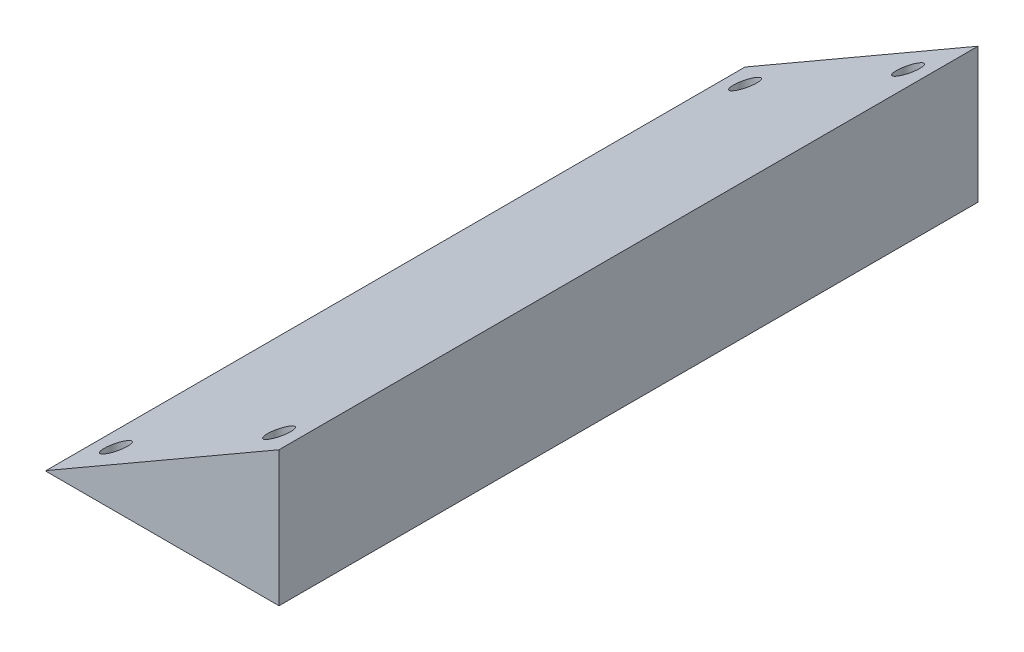
ISO-10303-21;
HEADER;
FILE_DESCRIPTION(('STEP AP214'),'2;1');
FILE_NAME('part.step','',(''),(''),'','','');
FILE_SCHEMA(('AUTOMOTIVE_DESIGN { 1 0 10303 214 1 1 1 1 }'));
ENDSEC;
DATA;
#1=APPLICATION_CONTEXT('core data for automotive mechanical design processes');
#2=APPLICATION_PROTOCOL_DEFINITION('international standard','automotive_design',2000,#1);
#3=PRODUCT_CONTEXT('',#1,'mechanical');
#4=PRODUCT('Part','Part','',(#3));
#5=PRODUCT_RELATED_PRODUCT_CATEGORY('part','',(#4));
#6=PRODUCT_DEFINITION_FORMATION('','',#4);
#7=PRODUCT_DEFINITION_CONTEXT('part definition',#1,'design');
#8=PRODUCT_DEFINITION('design','',#6,#7);
#9=PRODUCT_DEFINITION_SHAPE('','',#8);
#10=(LENGTH_UNIT() NAMED_UNIT(*) SI_UNIT(.MILLI.,.METRE.));
#11=(NAMED_UNIT(*) PLANE_ANGLE_UNIT() SI_UNIT($,.RADIAN.));
#12=(NAMED_UNIT(*) SI_UNIT($,.STERADIAN.) SOLID_ANGLE_UNIT());
#13=UNCERTAINTY_MEASURE_WITH_UNIT(LENGTH_MEASURE(1.E-05),#10,'distance_accuracy_value','');
#14=(GEOMETRIC_REPRESENTATION_CONTEXT(3) GLOBAL_UNCERTAINTY_ASSIGNED_CONTEXT((#13)) GLOBAL_UNIT_ASSIGNED_CONTEXT((#10,
#11,#12)) REPRESENTATION_CONTEXT('',''));
#15=CARTESIAN_POINT('',(0.,0.,0.));
#16=DIRECTION('',(0.,0.,1.));
#17=DIRECTION('',(1.,0.,0.));
#18=AXIS2_PLACEMENT_3D('',#15,#16,#17);
#19=CARTESIAN_POINT('',(-25.,0.132486540518385,75.));
#20=DIRECTION('',(1.,0.,0.));
#21=DIRECTION('',(0.,1.,0.));
#22=AXIS2_PLACEMENT_3D('',#19,#20,#21);
#23=PLANE('',#22);
#24=DIRECTION('',(0.,-1.,0.));
#25=VECTOR('',#24,1.);
#26=CARTESIAN_POINT('',(-25.,0.132486540518385,-75.));
#27=LINE('',#26,#25);
#28=CARTESIAN_POINT('',(-25.,0.132486540518385,-75.));
#29=VERTEX_POINT('',#28);
#30=CARTESIAN_POINT('',(-25.,0.,-75.));
#31=VERTEX_POINT('',#30);
#32=EDGE_CURVE('E111',#29,#31,#27,.T.);
#33=ORIENTED_EDGE('',*,*,#32,.T.);
#34=DIRECTION('',(0.,0.,-1.));
#35=VECTOR('',#34,1.);
#36=CARTESIAN_POINT('',(-25.,0.,75.));
#37=LINE('',#36,#35);
#38=CARTESIAN_POINT('',(-25.,0.,75.));
#39=VERTEX_POINT('',#38);
#40=EDGE_CURVE('E11',#39,#31,#37,.T.);
#41=ORIENTED_EDGE('',*,*,#40,.F.);
#42=DIRECTION('',(0.,-1.,0.));
#43=VECTOR('',#42,1.);
#44=CARTESIAN_POINT('',(-25.,0.132486540518385,75.));
#45=LINE('',#44,#43);
#46=CARTESIAN_POINT('',(-25.,0.132486540518385,75.));
#47=VERTEX_POINT('',#46);
#48=EDGE_CURVE('E94',#47,#39,#45,.T.);
#49=ORIENTED_EDGE('',*,*,#48,.F.);
#50=DIRECTION('',(0.,0.,-1.));
#51=VECTOR('',#50,1.);
#52=CARTESIAN_POINT('',(-25.,0.132486540518385,75.));
#53=LINE('',#52,#51);
#54=EDGE_CURVE('E107',#47,#29,#53,.T.);
#55=ORIENTED_EDGE('',*,*,#54,.T.);
#56=EDGE_LOOP('',(#33,#41,#49,#55));
#57=FACE_BOUND('',#56,.T.);
#58=ADVANCED_FACE('F40',(#57),#23,.F.);
#59=CARTESIAN_POINT('',(-25.,0.,75.));
#60=DIRECTION('',(0.,1.,0.));
#61=DIRECTION('',(0.,0.,1.));
#62=AXIS2_PLACEMENT_3D('',#59,#60,#61);
#63=PLANE('',#62);
#64=CARTESIAN_POINT('',(17.5,0.,67.5));
#65=DIRECTION('',(0.,-1.,0.));
#66=DIRECTION('',(0.,0.,-1.));
#67=AXIS2_PLACEMENT_3D('',#64,#65,#66);
#68=CIRCLE('',#67,2.5);
#69=CARTESIAN_POINT('',(17.5,0.,65.));
#70=VERTEX_POINT('',#69);
#71=EDGE_CURVE('E251',#70,#70,#68,.T.);
#72=ORIENTED_EDGE('',*,*,#71,.F.);
#73=EDGE_LOOP('',(#72));
#74=FACE_BOUND('',#73,.T.);
#75=CARTESIAN_POINT('',(-17.5,0.,-67.5));
#76=DIRECTION('',(0.,-1.,0.));
#77=DIRECTION('',(0.,0.,-1.));
#78=AXIS2_PLACEMENT_3D('',#75,#76,#77);
#79=CIRCLE('',#78,2.5);
#80=CARTESIAN_POINT('',(-17.5,0.,-70.));
#81=VERTEX_POINT('',#80);
#82=EDGE_CURVE('E247',#81,#81,#79,.T.);
#83=ORIENTED_EDGE('',*,*,#82,.F.);
#84=EDGE_LOOP('',(#83));
#85=FACE_BOUND('',#84,.T.);
#86=CARTESIAN_POINT('',(17.5,0.,-67.5));
#87=DIRECTION('',(0.,-1.,0.));
#88=DIRECTION('',(0.,0.,-1.));
#89=AXIS2_PLACEMENT_3D('',#86,#87,#88);
#90=CIRCLE('',#89,2.5);
#91=CARTESIAN_POINT('',(17.5,0.,-70.));
#92=VERTEX_POINT('',#91);
#93=EDGE_CURVE('E239',#92,#92,#90,.T.);
#94=ORIENTED_EDGE('',*,*,#93,.F.);
#95=EDGE_LOOP('',(#94));
#96=FACE_BOUND('',#95,.T.);
#97=CARTESIAN_POINT('',(-17.5,0.,67.5));
#98=DIRECTION('',(0.,-1.,0.));
#99=DIRECTION('',(0.,0.,-1.));
#100=AXIS2_PLACEMENT_3D('',#97,#98,#99);
#101=CIRCLE('',#100,2.5);
#102=CARTESIAN_POINT('',(-17.5,0.,65.));
#103=VERTEX_POINT('',#102);
#104=EDGE_CURVE('E130',#103,#103,#101,.T.);
#105=ORIENTED_EDGE('',*,*,#104,.F.);
#106=EDGE_LOOP('',(#105));
#107=FACE_BOUND('',#106,.T.);
#108=DIRECTION('',(1.,0.,0.));
#109=VECTOR('',#108,1.);
#110=CARTESIAN_POINT('',(-25.,0.,-75.));
#111=LINE('',#110,#109);
#112=CARTESIAN_POINT('',(25.,0.,-75.));
#113=VERTEX_POINT('',#112);
#114=EDGE_CURVE('E99',#31,#113,#111,.T.);
#115=ORIENTED_EDGE('',*,*,#114,.T.);
#116=DIRECTION('',(0.,0.,-1.));
#117=VECTOR('',#116,1.);
#118=CARTESIAN_POINT('',(25.,0.,75.));
#119=LINE('',#118,#117);
#120=CARTESIAN_POINT('',(25.,0.,75.));
#121=VERTEX_POINT('',#120);
#122=EDGE_CURVE('E50',#121,#113,#119,.T.);
#123=ORIENTED_EDGE('',*,*,#122,.F.);
#124=DIRECTION('',(1.,0.,0.));
#125=VECTOR('',#124,1.);
#126=CARTESIAN_POINT('',(-25.,0.,75.));
#127=LINE('',#126,#125);
#128=EDGE_CURVE('E89',#39,#121,#127,.T.);
#129=ORIENTED_EDGE('',*,*,#128,.F.);
#130=ORIENTED_EDGE('',*,*,#40,.T.);
#131=EDGE_LOOP('',(#115,#123,#129,#130));
#132=FACE_BOUND('',#131,.T.);
#133=ADVANCED_FACE('F98',(#74,#85,#96,#107,#132),#63,.F.);
#134=CARTESIAN_POINT('',(25.,0.,75.));
#135=DIRECTION('',(-1.,0.,0.));
#136=DIRECTION('',(0.,-1.,0.));
#137=AXIS2_PLACEMENT_3D('',#134,#135,#136);
#138=PLANE('',#137);
#139=DIRECTION('',(0.,1.,0.));
#140=VECTOR('',#139,1.);
#141=CARTESIAN_POINT('',(25.,0.,-75.));
#142=LINE('',#141,#140);
#143=CARTESIAN_POINT('',(25.,29.,-75.));
#144=VERTEX_POINT('',#143);
#145=EDGE_CURVE('E76',#113,#144,#142,.T.);
#146=ORIENTED_EDGE('',*,*,#145,.T.);
#147=DIRECTION('',(0.,0.,-1.));
#148=VECTOR('',#147,1.);
#149=CARTESIAN_POINT('',(25.,29.,75.));
#150=LINE('',#149,#148);
#151=CARTESIAN_POINT('',(25.,29.,75.));
#152=VERTEX_POINT('',#151);
#153=EDGE_CURVE('E101',#152,#144,#150,.T.);
#154=ORIENTED_EDGE('',*,*,#153,.F.);
#155=DIRECTION('',(0.,1.,0.));
#156=VECTOR('',#155,1.);
#157=CARTESIAN_POINT('',(25.,0.,75.));
#158=LINE('',#157,#156);
#159=EDGE_CURVE('E92',#121,#152,#158,.T.);
#160=ORIENTED_EDGE('',*,*,#159,.F.);
#161=ORIENTED_EDGE('',*,*,#122,.T.);
#162=EDGE_LOOP('',(#146,#154,#160,#161));
#163=FACE_BOUND('',#162,.T.);
#164=ADVANCED_FACE('F103',(#163),#138,.F.);
#165=CARTESIAN_POINT('',(25.,29.,75.));
#166=DIRECTION('',(0.500000000000004,-0.866025403784436,0.));
#167=DIRECTION('',(0.866025403784436,0.500000000000004,0.));
#168=AXIS2_PLACEMENT_3D('',#165,#166,#167);
#169=PLANE('',#168);
#170=CARTESIAN_POINT('',(17.5,24.6698729810778,67.5));
#171=DIRECTION('',(0.500000000000004,-0.866025403784436,0.));
#172=DIRECTION('',(-0.866025403784436,-0.500000000000004,0.));
#173=AXIS2_PLACEMENT_3D('',#170,#171,#172);
#174=ELLIPSE('',#173,2.88675134594814,2.5);
#175=CARTESIAN_POINT('',(15.,23.2264973081037,67.5));
#176=VERTEX_POINT('',#175);
#177=EDGE_CURVE('E43',#176,#176,#174,.T.);
#178=ORIENTED_EDGE('',*,*,#177,.T.);
#179=EDGE_LOOP('',(#178));
#180=FACE_BOUND('',#179,.T.);
#181=CARTESIAN_POINT('',(-17.5,4.46261355944062,-67.5));
#182=DIRECTION('',(0.500000000000004,-0.866025403784436,0.));
#183=DIRECTION('',(-0.866025403784436,-0.500000000000004,0.));
#184=AXIS2_PLACEMENT_3D('',#181,#182,#183);
#185=ELLIPSE('',#184,2.88675134594814,2.5);
#186=CARTESIAN_POINT('',(-20.,3.01923788646654,-67.5));
#187=VERTEX_POINT('',#186);
#188=EDGE_CURVE('E133',#187,#187,#185,.T.);
#189=ORIENTED_EDGE('',*,*,#188,.T.);
#190=EDGE_LOOP('',(#189));
#191=FACE_BOUND('',#190,.T.);
#192=CARTESIAN_POINT('',(17.5,24.6698729810778,-67.5));
#193=DIRECTION('',(0.500000000000004,-0.866025403784436,0.));
#194=DIRECTION('',(-0.866025403784436,-0.500000000000004,0.));
#195=AXIS2_PLACEMENT_3D('',#192,#193,#194);
#196=ELLIPSE('',#195,2.88675134594814,2.5);
#197=CARTESIAN_POINT('',(15.,23.2264973081037,-67.5));
#198=VERTEX_POINT('',#197);
#199=EDGE_CURVE('E129',#198,#198,#196,.T.);
#200=ORIENTED_EDGE('',*,*,#199,.T.);
#201=EDGE_LOOP('',(#200));
#202=FACE_BOUND('',#201,.T.);
#203=CARTESIAN_POINT('',(-17.5,4.46261355944062,67.5));
#204=DIRECTION('',(0.500000000000004,-0.866025403784436,0.));
#205=DIRECTION('',(-0.866025403784436,-0.500000000000004,0.));
#206=AXIS2_PLACEMENT_3D('',#203,#204,#205);
#207=ELLIPSE('',#206,2.88675134594814,2.5);
#208=CARTESIAN_POINT('',(-20.,3.01923788646654,67.5));
#209=VERTEX_POINT('',#208);
#210=EDGE_CURVE('E125',#209,#209,#207,.T.);
#211=ORIENTED_EDGE('',*,*,#210,.T.);
#212=EDGE_LOOP('',(#211));
#213=FACE_BOUND('',#212,.T.);
#214=DIRECTION('',(-0.866025403784436,-0.500000000000004,0.));
#215=VECTOR('',#214,1.);
#216=CARTESIAN_POINT('',(25.,29.,-75.));
#217=LINE('',#216,#215);
#218=EDGE_CURVE('E82',#144,#29,#217,.T.);
#219=ORIENTED_EDGE('',*,*,#218,.T.);
#220=ORIENTED_EDGE('',*,*,#54,.F.);
#221=DIRECTION('',(-0.866025403784436,-0.500000000000004,0.));
#222=VECTOR('',#221,1.);
#223=CARTESIAN_POINT('',(25.,29.,75.));
#224=LINE('',#223,#222);
#225=EDGE_CURVE('E59',#152,#47,#224,.T.);
#226=ORIENTED_EDGE('',*,*,#225,.F.);
#227=ORIENTED_EDGE('',*,*,#153,.T.);
#228=EDGE_LOOP('',(#219,#220,#226,#227));
#229=FACE_BOUND('',#228,.T.);
#230=ADVANCED_FACE('F142',(#180,#191,#202,#213,#229),#169,.F.);
#231=CARTESIAN_POINT('',(0.,0.,75.));
#232=DIRECTION('',(0.,0.,1.));
#233=DIRECTION('',(1.,0.,0.));
#234=AXIS2_PLACEMENT_3D('',#231,#232,#233);
#235=PLANE('',#234);
#236=ORIENTED_EDGE('',*,*,#48,.T.);
#237=ORIENTED_EDGE('',*,*,#128,.T.);
#238=ORIENTED_EDGE('',*,*,#159,.T.);
#239=ORIENTED_EDGE('',*,*,#225,.T.);
#240=EDGE_LOOP('',(#236,#237,#238,#239));
#241=FACE_BOUND('',#240,.T.);
#242=ADVANCED_FACE('F90',(#241),#235,.T.);
#243=CARTESIAN_POINT('',(0.,0.,-75.));
#244=DIRECTION('',(0.,0.,1.));
#245=DIRECTION('',(1.,0.,0.));
#246=AXIS2_PLACEMENT_3D('',#243,#244,#245);
#247=PLANE('',#246);
#248=ORIENTED_EDGE('',*,*,#32,.F.);
#249=ORIENTED_EDGE('',*,*,#218,.F.);
#250=ORIENTED_EDGE('',*,*,#145,.F.);
#251=ORIENTED_EDGE('',*,*,#114,.F.);
#252=EDGE_LOOP('',(#248,#249,#250,#251));
#253=FACE_BOUND('',#252,.T.);
#254=ADVANCED_FACE('F165',(#253),#247,.F.);
#255=CARTESIAN_POINT('',(-17.5,50.,67.5));
#256=DIRECTION('',(0.,-1.,0.));
#257=DIRECTION('',(0.,0.,-1.));
#258=AXIS2_PLACEMENT_3D('',#255,#256,#257);
#259=CYLINDRICAL_SURFACE('',#258,2.5);
#260=ORIENTED_EDGE('',*,*,#104,.T.);
#261=EDGE_LOOP('',(#260));
#262=FACE_BOUND('',#261,.T.);
#263=ORIENTED_EDGE('',*,*,#210,.F.);
#264=EDGE_LOOP('',(#263));
#265=FACE_BOUND('',#264,.T.);
#266=ADVANCED_FACE('F167',(#262,#265),#259,.F.);
#267=CARTESIAN_POINT('',(17.5,50.,-67.5));
#268=DIRECTION('',(0.,-1.,0.));
#269=DIRECTION('',(0.,0.,-1.));
#270=AXIS2_PLACEMENT_3D('',#267,#268,#269);
#271=CYLINDRICAL_SURFACE('',#270,2.5);
#272=ORIENTED_EDGE('',*,*,#93,.T.);
#273=EDGE_LOOP('',(#272));
#274=FACE_BOUND('',#273,.T.);
#275=ORIENTED_EDGE('',*,*,#199,.F.);
#276=EDGE_LOOP('',(#275));
#277=FACE_BOUND('',#276,.T.);
#278=ADVANCED_FACE('F152',(#274,#277),#271,.F.);
#279=CARTESIAN_POINT('',(-17.5,50.,-67.5));
#280=DIRECTION('',(0.,-1.,0.));
#281=DIRECTION('',(0.,0.,-1.));
#282=AXIS2_PLACEMENT_3D('',#279,#280,#281);
#283=CYLINDRICAL_SURFACE('',#282,2.5);
#284=ORIENTED_EDGE('',*,*,#82,.T.);
#285=EDGE_LOOP('',(#284));
#286=FACE_BOUND('',#285,.T.);
#287=ORIENTED_EDGE('',*,*,#188,.F.);
#288=EDGE_LOOP('',(#287));
#289=FACE_BOUND('',#288,.T.);
#290=ADVANCED_FACE('F146',(#286,#289),#283,.F.);
#291=CARTESIAN_POINT('',(17.5,50.,67.5));
#292=DIRECTION('',(0.,-1.,0.));
#293=DIRECTION('',(0.,0.,-1.));
#294=AXIS2_PLACEMENT_3D('',#291,#292,#293);
#295=CYLINDRICAL_SURFACE('',#294,2.5);
#296=ORIENTED_EDGE('',*,*,#71,.T.);
#297=EDGE_LOOP('',(#296));
#298=FACE_BOUND('',#297,.T.);
#299=ORIENTED_EDGE('',*,*,#177,.F.);
#300=EDGE_LOOP('',(#299));
#301=FACE_BOUND('',#300,.T.);
#302=ADVANCED_FACE('F144',(#298,#301),#295,.F.);
#303=CLOSED_SHELL('',(#58,#133,#164,#230,#242,#254,#266,#278,#290,#302));
#304=MANIFOLD_SOLID_BREP('B2',#303);
#305=ADVANCED_BREP_SHAPE_REPRESENTATION('',(#18,#304),#14);
#306=SHAPE_DEFINITION_REPRESENTATION(#9,#305);
ENDSEC;
END-ISO-10303-21;
